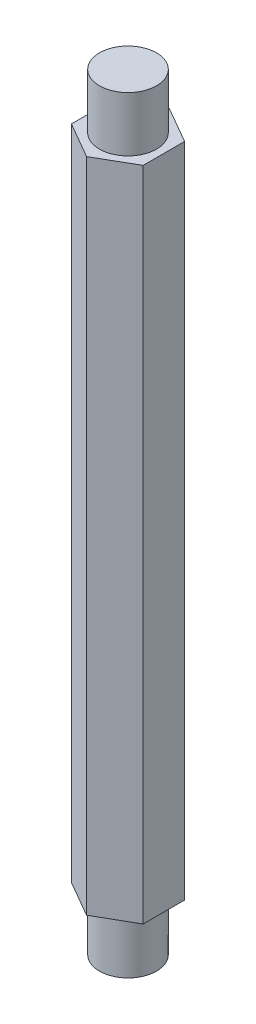
ISO-10303-21;
HEADER;
FILE_DESCRIPTION(('STEP AP214'),'2;1');
FILE_NAME('part.step','',(''),(''),'','','');
FILE_SCHEMA(('AUTOMOTIVE_DESIGN { 1 0 10303 214 1 1 1 1 }'));
ENDSEC;
DATA;
#1=APPLICATION_CONTEXT('core data for automotive mechanical design processes');
#2=APPLICATION_PROTOCOL_DEFINITION('international standard','automotive_design',2000,#1);
#3=PRODUCT_CONTEXT('',#1,'mechanical');
#4=PRODUCT('Part','Part','',(#3));
#5=PRODUCT_RELATED_PRODUCT_CATEGORY('part','',(#4));
#6=PRODUCT_DEFINITION_FORMATION('','',#4);
#7=PRODUCT_DEFINITION_CONTEXT('part definition',#1,'design');
#8=PRODUCT_DEFINITION('design','',#6,#7);
#9=PRODUCT_DEFINITION_SHAPE('','',#8);
#10=(LENGTH_UNIT() NAMED_UNIT(*) SI_UNIT(.MILLI.,.METRE.));
#11=(NAMED_UNIT(*) PLANE_ANGLE_UNIT() SI_UNIT($,.RADIAN.));
#12=(NAMED_UNIT(*) SI_UNIT($,.STERADIAN.) SOLID_ANGLE_UNIT());
#13=UNCERTAINTY_MEASURE_WITH_UNIT(LENGTH_MEASURE(1.E-05),#10,'distance_accuracy_value','');
#14=(GEOMETRIC_REPRESENTATION_CONTEXT(3) GLOBAL_UNCERTAINTY_ASSIGNED_CONTEXT((#13)) GLOBAL_UNIT_ASSIGNED_CONTEXT((#10,
#11,#12)) REPRESENTATION_CONTEXT('',''));
#15=CARTESIAN_POINT('',(0.,0.,0.));
#16=DIRECTION('',(0.,0.,1.));
#17=DIRECTION('',(1.,0.,0.));
#18=AXIS2_PLACEMENT_3D('',#15,#16,#17);
#19=CARTESIAN_POINT('',(0.,41.175,0.));
#20=DIRECTION('',(0.,-1.,0.));
#21=DIRECTION('',(0.,0.,-1.));
#22=AXIS2_PLACEMENT_3D('',#19,#20,#21);
#23=CYLINDRICAL_SURFACE('',#22,1.65);
#24=CARTESIAN_POINT('',(0.,41.175,0.));
#25=DIRECTION('',(0.,1.,0.));
#26=DIRECTION('',(0.,0.,1.));
#27=AXIS2_PLACEMENT_3D('',#24,#25,#26);
#28=CIRCLE('',#27,1.65);
#29=CARTESIAN_POINT('',(0.,41.175,1.65));
#30=VERTEX_POINT('',#29);
#31=EDGE_CURVE('E11',#30,#30,#28,.T.);
#32=ORIENTED_EDGE('',*,*,#31,.F.);
#33=EDGE_LOOP('',(#32));
#34=FACE_BOUND('',#33,.T.);
#35=CARTESIAN_POINT('',(0.,38.,0.));
#36=DIRECTION('',(0.,1.,0.));
#37=DIRECTION('',(0.,0.,1.));
#38=AXIS2_PLACEMENT_3D('',#35,#36,#37);
#39=CIRCLE('',#38,1.65);
#40=CARTESIAN_POINT('',(0.,38.,1.65));
#41=VERTEX_POINT('',#40);
#42=EDGE_CURVE('E43',#41,#41,#39,.T.);
#43=ORIENTED_EDGE('',*,*,#42,.T.);
#44=EDGE_LOOP('',(#43));
#45=FACE_BOUND('',#44,.T.);
#46=ADVANCED_FACE('F40',(#34,#45),#23,.T.);
#47=CARTESIAN_POINT('',(0.,41.175,0.));
#48=DIRECTION('',(0.,1.,0.));
#49=DIRECTION('',(0.,0.,1.));
#50=AXIS2_PLACEMENT_3D('',#47,#48,#49);
#51=PLANE('',#50);
#52=ORIENTED_EDGE('',*,*,#31,.T.);
#53=EDGE_LOOP('',(#52));
#54=FACE_BOUND('',#53,.T.);
#55=ADVANCED_FACE('F55',(#54),#51,.T.);
#56=CARTESIAN_POINT('',(0.,38.,0.));
#57=DIRECTION('',(0.,1.,0.));
#58=DIRECTION('',(0.,0.,1.));
#59=AXIS2_PLACEMENT_3D('',#56,#57,#58);
#60=PLANE('',#59);
#61=ORIENTED_EDGE('',*,*,#42,.F.);
#62=EDGE_LOOP('',(#61));
#63=FACE_BOUND('',#62,.T.);
#64=ADVANCED_FACE('F53',(#63),#60,.F.);
#65=CLOSED_SHELL('',(#46,#55,#64));
#66=MANIFOLD_SOLID_BREP('B2',#65);
#67=CARTESIAN_POINT('',(0.,-3.175,0.));
#68=DIRECTION('',(0.,1.,0.));
#69=DIRECTION('',(0.,0.,1.));
#70=AXIS2_PLACEMENT_3D('',#67,#68,#69);
#71=CYLINDRICAL_SURFACE('',#70,1.65);
#72=CARTESIAN_POINT('',(0.,-3.175,0.));
#73=DIRECTION('',(0.,-1.,0.));
#74=DIRECTION('',(0.,0.,-1.));
#75=AXIS2_PLACEMENT_3D('',#72,#73,#74);
#76=CIRCLE('',#75,1.65);
#77=CARTESIAN_POINT('',(0.,-3.175,-1.65));
#78=VERTEX_POINT('',#77);
#79=EDGE_CURVE('E39',#78,#78,#76,.T.);
#80=ORIENTED_EDGE('',*,*,#79,.F.);
#81=EDGE_LOOP('',(#80));
#82=FACE_BOUND('',#81,.T.);
#83=CARTESIAN_POINT('',(0.,0.,0.));
#84=DIRECTION('',(0.,-1.,0.));
#85=DIRECTION('',(0.,0.,-1.));
#86=AXIS2_PLACEMENT_3D('',#83,#84,#85);
#87=CIRCLE('',#86,1.65);
#88=CARTESIAN_POINT('',(0.,0.,-1.65));
#89=VERTEX_POINT('',#88);
#90=EDGE_CURVE('E92',#89,#89,#87,.T.);
#91=ORIENTED_EDGE('',*,*,#90,.T.);
#92=EDGE_LOOP('',(#91));
#93=FACE_BOUND('',#92,.T.);
#94=ADVANCED_FACE('F89',(#82,#93),#71,.T.);
#95=CARTESIAN_POINT('',(0.,-3.175,0.));
#96=DIRECTION('',(0.,-1.,0.));
#97=DIRECTION('',(0.,0.,-1.));
#98=AXIS2_PLACEMENT_3D('',#95,#96,#97);
#99=PLANE('',#98);
#100=ORIENTED_EDGE('',*,*,#79,.T.);
#101=EDGE_LOOP('',(#100));
#102=FACE_BOUND('',#101,.T.);
#103=ADVANCED_FACE('F104',(#102),#99,.T.);
#104=CARTESIAN_POINT('',(0.,0.,0.));
#105=DIRECTION('',(0.,-1.,0.));
#106=DIRECTION('',(0.,0.,-1.));
#107=AXIS2_PLACEMENT_3D('',#104,#105,#106);
#108=PLANE('',#107);
#109=ORIENTED_EDGE('',*,*,#90,.F.);
#110=EDGE_LOOP('',(#109));
#111=FACE_BOUND('',#110,.T.);
#112=ADVANCED_FACE('F102',(#111),#108,.F.);
#113=CLOSED_SHELL('',(#94,#103,#112));
#114=MANIFOLD_SOLID_BREP('B6',#113);
#115=CARTESIAN_POINT('',(0.,38.,0.));
#116=DIRECTION('',(0.,1.,0.));
#117=DIRECTION('',(0.,0.,1.));
#118=AXIS2_PLACEMENT_3D('',#115,#116,#117);
#119=PLANE('',#118);
#120=DIRECTION('',(0.866025403784439,0.,0.5));
#121=VECTOR('',#120,1.);
#122=CARTESIAN_POINT('',(-2.075,38.,1.19800180856847));
#123=LINE('',#122,#121);
#124=CARTESIAN_POINT('',(-2.075,38.,1.19800180856847));
#125=VERTEX_POINT('',#124);
#126=CARTESIAN_POINT('',(0.,38.,2.39600361713695));
#127=VERTEX_POINT('',#126);
#128=EDGE_CURVE('E226',#125,#127,#123,.T.);
#129=ORIENTED_EDGE('',*,*,#128,.T.);
#130=DIRECTION('',(0.866025403784438,0.,-0.5));
#131=VECTOR('',#130,1.);
#132=CARTESIAN_POINT('',(0.,38.,2.39600361713695));
#133=LINE('',#132,#131);
#134=CARTESIAN_POINT('',(2.075,38.,1.19800180856847));
#135=VERTEX_POINT('',#134);
#136=EDGE_CURVE('E184',#127,#135,#133,.T.);
#137=ORIENTED_EDGE('',*,*,#136,.T.);
#138=DIRECTION('',(0.,0.,-1.));
#139=VECTOR('',#138,1.);
#140=CARTESIAN_POINT('',(2.075,38.,1.19800180856847));
#141=LINE('',#140,#139);
#142=CARTESIAN_POINT('',(2.075,38.,-1.19800180856847));
#143=VERTEX_POINT('',#142);
#144=EDGE_CURVE('E197',#135,#143,#141,.T.);
#145=ORIENTED_EDGE('',*,*,#144,.T.);
#146=DIRECTION('',(-0.866025403784439,0.,-0.5));
#147=VECTOR('',#146,1.);
#148=CARTESIAN_POINT('',(2.075,38.,-1.19800180856847));
#149=LINE('',#148,#147);
#150=CARTESIAN_POINT('',(0.,38.,-2.39600361713695));
#151=VERTEX_POINT('',#150);
#152=EDGE_CURVE('E191',#143,#151,#149,.T.);
#153=ORIENTED_EDGE('',*,*,#152,.T.);
#154=DIRECTION('',(-0.866025403784439,0.,0.5));
#155=VECTOR('',#154,1.);
#156=CARTESIAN_POINT('',(0.,38.,-2.39600361713695));
#157=LINE('',#156,#155);
#158=CARTESIAN_POINT('',(-2.075,38.,-1.19800180856847));
#159=VERTEX_POINT('',#158);
#160=EDGE_CURVE('E195',#151,#159,#157,.T.);
#161=ORIENTED_EDGE('',*,*,#160,.T.);
#162=DIRECTION('',(0.,0.,1.));
#163=VECTOR('',#162,1.);
#164=CARTESIAN_POINT('',(-2.075,38.,-1.19800180856847));
#165=LINE('',#164,#163);
#166=EDGE_CURVE('E147',#159,#125,#165,.T.);
#167=ORIENTED_EDGE('',*,*,#166,.T.);
#168=EDGE_LOOP('',(#129,#137,#145,#153,#161,#167));
#169=FACE_BOUND('',#168,.T.);
#170=CARTESIAN_POINT('',(0.,38.,0.));
#171=DIRECTION('',(0.,1.,0.));
#172=DIRECTION('',(0.,0.,1.));
#173=AXIS2_PLACEMENT_3D('',#170,#171,#172);
#174=CIRCLE('',#173,1.65);
#175=CARTESIAN_POINT('',(0.,38.,1.65));
#176=VERTEX_POINT('',#175);
#177=EDGE_CURVE('E219',#176,#176,#174,.T.);
#178=ORIENTED_EDGE('',*,*,#177,.F.);
#179=EDGE_LOOP('',(#178));
#180=FACE_BOUND('',#179,.T.);
#181=ADVANCED_FACE('F130',(#169,#180),#119,.T.);
#182=CARTESIAN_POINT('',(0.,0.,0.));
#183=DIRECTION('',(0.,1.,0.));
#184=DIRECTION('',(0.,0.,1.));
#185=AXIS2_PLACEMENT_3D('',#182,#183,#184);
#186=PLANE('',#185);
#187=DIRECTION('',(0.866025403784439,0.,0.5));
#188=VECTOR('',#187,1.);
#189=CARTESIAN_POINT('',(-2.075,0.,1.19800180856847));
#190=LINE('',#189,#188);
#191=CARTESIAN_POINT('',(-2.075,0.,1.19800180856847));
#192=VERTEX_POINT('',#191);
#193=CARTESIAN_POINT('',(0.,0.,2.39600361713695));
#194=VERTEX_POINT('',#193);
#195=EDGE_CURVE('E215',#192,#194,#190,.T.);
#196=ORIENTED_EDGE('',*,*,#195,.F.);
#197=DIRECTION('',(0.,0.,1.));
#198=VECTOR('',#197,1.);
#199=CARTESIAN_POINT('',(-2.075,0.,-1.19800180856847));
#200=LINE('',#199,#198);
#201=CARTESIAN_POINT('',(-2.075,0.,-1.19800180856847));
#202=VERTEX_POINT('',#201);
#203=EDGE_CURVE('E176',#202,#192,#200,.T.);
#204=ORIENTED_EDGE('',*,*,#203,.F.);
#205=DIRECTION('',(-0.866025403784439,0.,0.5));
#206=VECTOR('',#205,1.);
#207=CARTESIAN_POINT('',(0.,0.,-2.39600361713695));
#208=LINE('',#207,#206);
#209=CARTESIAN_POINT('',(0.,0.,-2.39600361713695));
#210=VERTEX_POINT('',#209);
#211=EDGE_CURVE('E170',#210,#202,#208,.T.);
#212=ORIENTED_EDGE('',*,*,#211,.F.);
#213=DIRECTION('',(-0.866025403784439,0.,-0.5));
#214=VECTOR('',#213,1.);
#215=CARTESIAN_POINT('',(2.075,0.,-1.19800180856847));
#216=LINE('',#215,#214);
#217=CARTESIAN_POINT('',(2.075,0.,-1.19800180856847));
#218=VERTEX_POINT('',#217);
#219=EDGE_CURVE('E205',#218,#210,#216,.T.);
#220=ORIENTED_EDGE('',*,*,#219,.F.);
#221=DIRECTION('',(0.,0.,-1.));
#222=VECTOR('',#221,1.);
#223=CARTESIAN_POINT('',(2.075,0.,1.19800180856847));
#224=LINE('',#223,#222);
#225=CARTESIAN_POINT('',(2.075,0.,1.19800180856847));
#226=VERTEX_POINT('',#225);
#227=EDGE_CURVE('E221',#226,#218,#224,.T.);
#228=ORIENTED_EDGE('',*,*,#227,.F.);
#229=DIRECTION('',(0.866025403784438,0.,-0.5));
#230=VECTOR('',#229,1.);
#231=CARTESIAN_POINT('',(0.,0.,2.39600361713695));
#232=LINE('',#231,#230);
#233=EDGE_CURVE('E218',#194,#226,#232,.T.);
#234=ORIENTED_EDGE('',*,*,#233,.F.);
#235=EDGE_LOOP('',(#196,#204,#212,#220,#228,#234));
#236=FACE_BOUND('',#235,.T.);
#237=CARTESIAN_POINT('',(0.,0.,0.));
#238=DIRECTION('',(0.,1.,0.));
#239=DIRECTION('',(0.,0.,1.));
#240=AXIS2_PLACEMENT_3D('',#237,#238,#239);
#241=CIRCLE('',#240,1.65);
#242=CARTESIAN_POINT('',(0.,0.,1.65));
#243=VERTEX_POINT('',#242);
#244=EDGE_CURVE('E319',#243,#243,#241,.T.);
#245=ORIENTED_EDGE('',*,*,#244,.T.);
#246=EDGE_LOOP('',(#245));
#247=FACE_BOUND('',#246,.T.);
#248=ADVANCED_FACE('F235',(#236,#247),#186,.F.);
#249=CARTESIAN_POINT('',(-2.075,38.,1.19800180856847));
#250=DIRECTION('',(0.5,0.,-0.866025403784439));
#251=DIRECTION('',(-0.866025403784439,0.,-0.5));
#252=AXIS2_PLACEMENT_3D('',#249,#250,#251);
#253=PLANE('',#252);
#254=ORIENTED_EDGE('',*,*,#195,.T.);
#255=DIRECTION('',(0.,-1.,0.));
#256=VECTOR('',#255,1.);
#257=CARTESIAN_POINT('',(0.,38.,2.39600361713695));
#258=LINE('',#257,#256);
#259=EDGE_CURVE('E87',#127,#194,#258,.T.);
#260=ORIENTED_EDGE('',*,*,#259,.F.);
#261=ORIENTED_EDGE('',*,*,#128,.F.);
#262=DIRECTION('',(0.,-1.,0.));
#263=VECTOR('',#262,1.);
#264=CARTESIAN_POINT('',(-2.075,38.,1.19800180856847));
#265=LINE('',#264,#263);
#266=EDGE_CURVE('E211',#125,#192,#265,.T.);
#267=ORIENTED_EDGE('',*,*,#266,.T.);
#268=EDGE_LOOP('',(#254,#260,#261,#267));
#269=FACE_BOUND('',#268,.T.);
#270=ADVANCED_FACE('F132',(#269),#253,.F.);
#271=CARTESIAN_POINT('',(0.,38.,2.39600361713695));
#272=DIRECTION('',(-0.5,0.,-0.866025403784439));
#273=DIRECTION('',(-0.866025403784439,0.,0.5));
#274=AXIS2_PLACEMENT_3D('',#271,#272,#273);
#275=PLANE('',#274);
#276=ORIENTED_EDGE('',*,*,#233,.T.);
#277=DIRECTION('',(0.,-1.,0.));
#278=VECTOR('',#277,1.);
#279=CARTESIAN_POINT('',(2.075,38.,1.19800180856847));
#280=LINE('',#279,#278);
#281=EDGE_CURVE('E139',#135,#226,#280,.T.);
#282=ORIENTED_EDGE('',*,*,#281,.F.);
#283=ORIENTED_EDGE('',*,*,#136,.F.);
#284=ORIENTED_EDGE('',*,*,#259,.T.);
#285=EDGE_LOOP('',(#276,#282,#283,#284));
#286=FACE_BOUND('',#285,.T.);
#287=ADVANCED_FACE('F260',(#286),#275,.F.);
#288=CARTESIAN_POINT('',(2.075,38.,1.19800180856847));
#289=DIRECTION('',(-1.,0.,0.));
#290=DIRECTION('',(0.,0.,1.));
#291=AXIS2_PLACEMENT_3D('',#288,#289,#290);
#292=PLANE('',#291);
#293=ORIENTED_EDGE('',*,*,#227,.T.);
#294=DIRECTION('',(0.,-1.,0.));
#295=VECTOR('',#294,1.);
#296=CARTESIAN_POINT('',(2.075,38.,-1.19800180856847));
#297=LINE('',#296,#295);
#298=EDGE_CURVE('E206',#143,#218,#297,.T.);
#299=ORIENTED_EDGE('',*,*,#298,.F.);
#300=ORIENTED_EDGE('',*,*,#144,.F.);
#301=ORIENTED_EDGE('',*,*,#281,.T.);
#302=EDGE_LOOP('',(#293,#299,#300,#301));
#303=FACE_BOUND('',#302,.T.);
#304=ADVANCED_FACE('F232',(#303),#292,.F.);
#305=CARTESIAN_POINT('',(2.075,38.,-1.19800180856847));
#306=DIRECTION('',(-0.5,0.,0.866025403784439));
#307=DIRECTION('',(0.866025403784439,0.,0.5));
#308=AXIS2_PLACEMENT_3D('',#305,#306,#307);
#309=PLANE('',#308);
#310=ORIENTED_EDGE('',*,*,#219,.T.);
#311=DIRECTION('',(0.,-1.,0.));
#312=VECTOR('',#311,1.);
#313=CARTESIAN_POINT('',(0.,38.,-2.39600361713695));
#314=LINE('',#313,#312);
#315=EDGE_CURVE('E202',#151,#210,#314,.T.);
#316=ORIENTED_EDGE('',*,*,#315,.F.);
#317=ORIENTED_EDGE('',*,*,#152,.F.);
#318=ORIENTED_EDGE('',*,*,#298,.T.);
#319=EDGE_LOOP('',(#310,#316,#317,#318));
#320=FACE_BOUND('',#319,.T.);
#321=ADVANCED_FACE('F203',(#320),#309,.F.);
#322=CARTESIAN_POINT('',(0.,38.,-2.39600361713695));
#323=DIRECTION('',(0.5,0.,0.866025403784439));
#324=DIRECTION('',(0.866025403784439,0.,-0.5));
#325=AXIS2_PLACEMENT_3D('',#322,#323,#324);
#326=PLANE('',#325);
#327=ORIENTED_EDGE('',*,*,#211,.T.);
#328=DIRECTION('',(0.,-1.,0.));
#329=VECTOR('',#328,1.);
#330=CARTESIAN_POINT('',(-2.075,38.,-1.19800180856847));
#331=LINE('',#330,#329);
#332=EDGE_CURVE('E207',#159,#202,#331,.T.);
#333=ORIENTED_EDGE('',*,*,#332,.F.);
#334=ORIENTED_EDGE('',*,*,#160,.F.);
#335=ORIENTED_EDGE('',*,*,#315,.T.);
#336=EDGE_LOOP('',(#327,#333,#334,#335));
#337=FACE_BOUND('',#336,.T.);
#338=ADVANCED_FACE('F209',(#337),#326,.F.);
#339=CARTESIAN_POINT('',(-2.075,38.,-1.19800180856847));
#340=DIRECTION('',(1.,0.,0.));
#341=DIRECTION('',(0.,0.,-1.));
#342=AXIS2_PLACEMENT_3D('',#339,#340,#341);
#343=PLANE('',#342);
#344=ORIENTED_EDGE('',*,*,#203,.T.);
#345=ORIENTED_EDGE('',*,*,#266,.F.);
#346=ORIENTED_EDGE('',*,*,#166,.F.);
#347=ORIENTED_EDGE('',*,*,#332,.T.);
#348=EDGE_LOOP('',(#344,#345,#346,#347));
#349=FACE_BOUND('',#348,.T.);
#350=ADVANCED_FACE('F240',(#349),#343,.F.);
#351=CARTESIAN_POINT('',(0.,38.,0.));
#352=DIRECTION('',(0.,-1.,0.));
#353=DIRECTION('',(0.,0.,-1.));
#354=AXIS2_PLACEMENT_3D('',#351,#352,#353);
#355=CYLINDRICAL_SURFACE('',#354,1.65);
#356=ORIENTED_EDGE('',*,*,#177,.T.);
#357=EDGE_LOOP('',(#356));
#358=FACE_BOUND('',#357,.T.);
#359=ORIENTED_EDGE('',*,*,#244,.F.);
#360=EDGE_LOOP('',(#359));
#361=FACE_BOUND('',#360,.T.);
#362=ADVANCED_FACE('F242',(#358,#361),#355,.F.);
#363=CLOSED_SHELL('',(#181,#248,#270,#287,#304,#321,#338,#350,#362));
#364=MANIFOLD_SOLID_BREP('B34',#363);
#365=ADVANCED_BREP_SHAPE_REPRESENTATION('',(#18,#66,#114,#364),#14);
#366=SHAPE_DEFINITION_REPRESENTATION(#9,#365);
ENDSEC;
END-ISO-10303-21;
